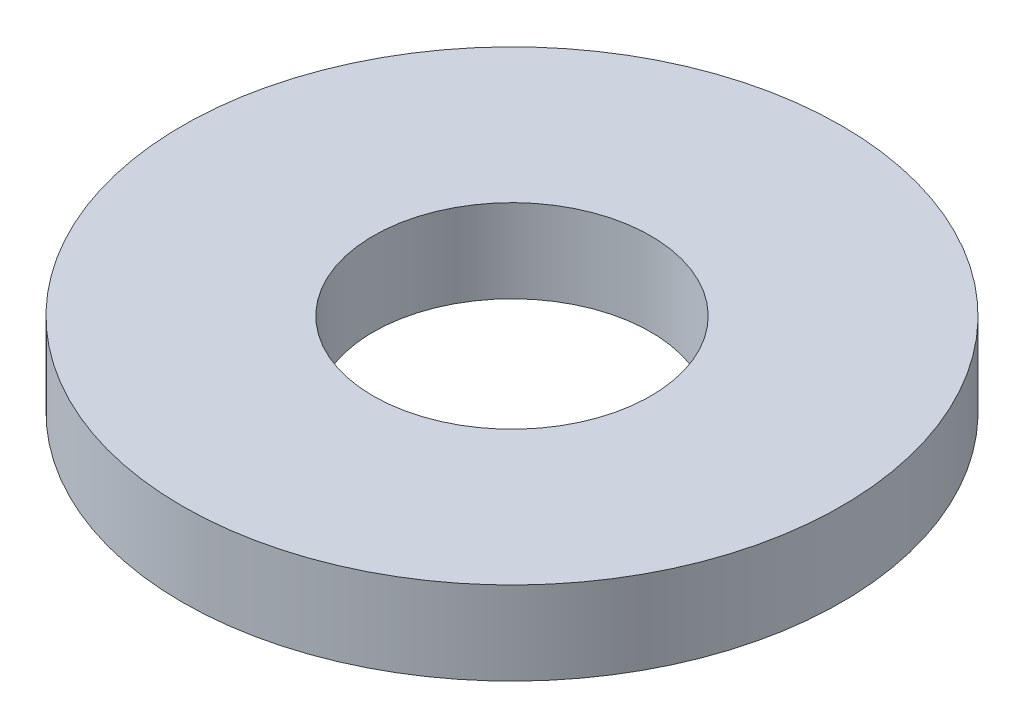
ISO-10303-21;
HEADER;
FILE_DESCRIPTION(('STEP AP214'),'2;1');
FILE_NAME('part.step','',(''),(''),'','','');
FILE_SCHEMA(('AUTOMOTIVE_DESIGN { 1 0 10303 214 1 1 1 1 }'));
ENDSEC;
DATA;
#1=APPLICATION_CONTEXT('core data for automotive mechanical design processes');
#2=APPLICATION_PROTOCOL_DEFINITION('international standard','automotive_design',2000,#1);
#3=PRODUCT_CONTEXT('',#1,'mechanical');
#4=PRODUCT('Part','Part','',(#3));
#5=PRODUCT_RELATED_PRODUCT_CATEGORY('part','',(#4));
#6=PRODUCT_DEFINITION_FORMATION('','',#4);
#7=PRODUCT_DEFINITION_CONTEXT('part definition',#1,'design');
#8=PRODUCT_DEFINITION('design','',#6,#7);
#9=PRODUCT_DEFINITION_SHAPE('','',#8);
#10=(LENGTH_UNIT() NAMED_UNIT(*) SI_UNIT(.MILLI.,.METRE.));
#11=(NAMED_UNIT(*) PLANE_ANGLE_UNIT() SI_UNIT($,.RADIAN.));
#12=(NAMED_UNIT(*) SI_UNIT($,.STERADIAN.) SOLID_ANGLE_UNIT());
#13=UNCERTAINTY_MEASURE_WITH_UNIT(LENGTH_MEASURE(1.E-05),#10,'distance_accuracy_value','');
#14=(GEOMETRIC_REPRESENTATION_CONTEXT(3) GLOBAL_UNCERTAINTY_ASSIGNED_CONTEXT((#13)) GLOBAL_UNIT_ASSIGNED_CONTEXT((#10,
#11,#12)) REPRESENTATION_CONTEXT('',''));
#15=CARTESIAN_POINT('',(0.,0.,0.));
#16=DIRECTION('',(0.,0.,1.));
#17=DIRECTION('',(1.,0.,0.));
#18=AXIS2_PLACEMENT_3D('',#15,#16,#17);
#19=CARTESIAN_POINT('',(0.,24.,0.));
#20=DIRECTION('',(0.,-1.,0.));
#21=DIRECTION('',(0.,0.,-1.));
#22=AXIS2_PLACEMENT_3D('',#19,#20,#21);
#23=CYLINDRICAL_SURFACE('',#22,95.);
#24=CARTESIAN_POINT('',(0.,24.,0.));
#25=DIRECTION('',(0.,1.,0.));
#26=DIRECTION('',(0.,0.,1.));
#27=AXIS2_PLACEMENT_3D('',#24,#25,#26);
#28=CIRCLE('',#27,95.);
#29=CARTESIAN_POINT('',(0.,24.,95.));
#30=VERTEX_POINT('',#29);
#31=EDGE_CURVE('E10',#30,#30,#28,.T.);
#32=ORIENTED_EDGE('',*,*,#31,.F.);
#33=EDGE_LOOP('',(#32));
#34=FACE_BOUND('',#33,.T.);
#35=CARTESIAN_POINT('',(0.,0.,0.));
#36=DIRECTION('',(0.,1.,0.));
#37=DIRECTION('',(0.,0.,1.));
#38=AXIS2_PLACEMENT_3D('',#35,#36,#37);
#39=CIRCLE('',#38,95.);
#40=CARTESIAN_POINT('',(0.,0.,95.));
#41=VERTEX_POINT('',#40);
#42=EDGE_CURVE('E37',#41,#41,#39,.T.);
#43=ORIENTED_EDGE('',*,*,#42,.T.);
#44=EDGE_LOOP('',(#43));
#45=FACE_BOUND('',#44,.T.);
#46=ADVANCED_FACE('F40',(#34,#45),#23,.T.);
#47=CARTESIAN_POINT('',(0.,24.,0.));
#48=DIRECTION('',(0.,1.,0.));
#49=DIRECTION('',(0.,0.,1.));
#50=AXIS2_PLACEMENT_3D('',#47,#48,#49);
#51=PLANE('',#50);
#52=CARTESIAN_POINT('',(0.,24.,0.));
#53=DIRECTION('',(0.,1.,0.));
#54=DIRECTION('',(0.,0.,1.));
#55=AXIS2_PLACEMENT_3D('',#52,#53,#54);
#56=CIRCLE('',#55,40.);
#57=CARTESIAN_POINT('',(0.,24.,40.));
#58=VERTEX_POINT('',#57);
#59=EDGE_CURVE('E50',#58,#58,#56,.T.);
#60=ORIENTED_EDGE('',*,*,#59,.F.);
#61=EDGE_LOOP('',(#60));
#62=FACE_BOUND('',#61,.T.);
#63=ORIENTED_EDGE('',*,*,#31,.T.);
#64=EDGE_LOOP('',(#63));
#65=FACE_BOUND('',#64,.T.);
#66=ADVANCED_FACE('F59',(#62,#65),#51,.T.);
#67=CARTESIAN_POINT('',(0.,0.,0.));
#68=DIRECTION('',(0.,1.,0.));
#69=DIRECTION('',(0.,0.,1.));
#70=AXIS2_PLACEMENT_3D('',#67,#68,#69);
#71=PLANE('',#70);
#72=CARTESIAN_POINT('',(0.,0.,0.));
#73=DIRECTION('',(0.,1.,0.));
#74=DIRECTION('',(0.,0.,1.));
#75=AXIS2_PLACEMENT_3D('',#72,#73,#74);
#76=CIRCLE('',#75,40.);
#77=CARTESIAN_POINT('',(0.,0.,40.));
#78=VERTEX_POINT('',#77);
#79=EDGE_CURVE('E47',#78,#78,#76,.T.);
#80=ORIENTED_EDGE('',*,*,#79,.T.);
#81=EDGE_LOOP('',(#80));
#82=FACE_BOUND('',#81,.T.);
#83=ORIENTED_EDGE('',*,*,#42,.F.);
#84=EDGE_LOOP('',(#83));
#85=FACE_BOUND('',#84,.T.);
#86=ADVANCED_FACE('F58',(#82,#85),#71,.F.);
#87=CARTESIAN_POINT('',(0.,24.,0.));
#88=DIRECTION('',(0.,-1.,0.));
#89=DIRECTION('',(0.,0.,-1.));
#90=AXIS2_PLACEMENT_3D('',#87,#88,#89);
#91=CYLINDRICAL_SURFACE('',#90,40.);
#92=ORIENTED_EDGE('',*,*,#59,.T.);
#93=EDGE_LOOP('',(#92));
#94=FACE_BOUND('',#93,.T.);
#95=ORIENTED_EDGE('',*,*,#79,.F.);
#96=EDGE_LOOP('',(#95));
#97=FACE_BOUND('',#96,.T.);
#98=ADVANCED_FACE('F54',(#94,#97),#91,.F.);
#99=CLOSED_SHELL('',(#46,#66,#86,#98));
#100=MANIFOLD_SOLID_BREP('B2',#99);
#101=ADVANCED_BREP_SHAPE_REPRESENTATION('',(#18,#100),#14);
#102=SHAPE_DEFINITION_REPRESENTATION(#9,#101);
ENDSEC;
END-ISO-10303-21;
